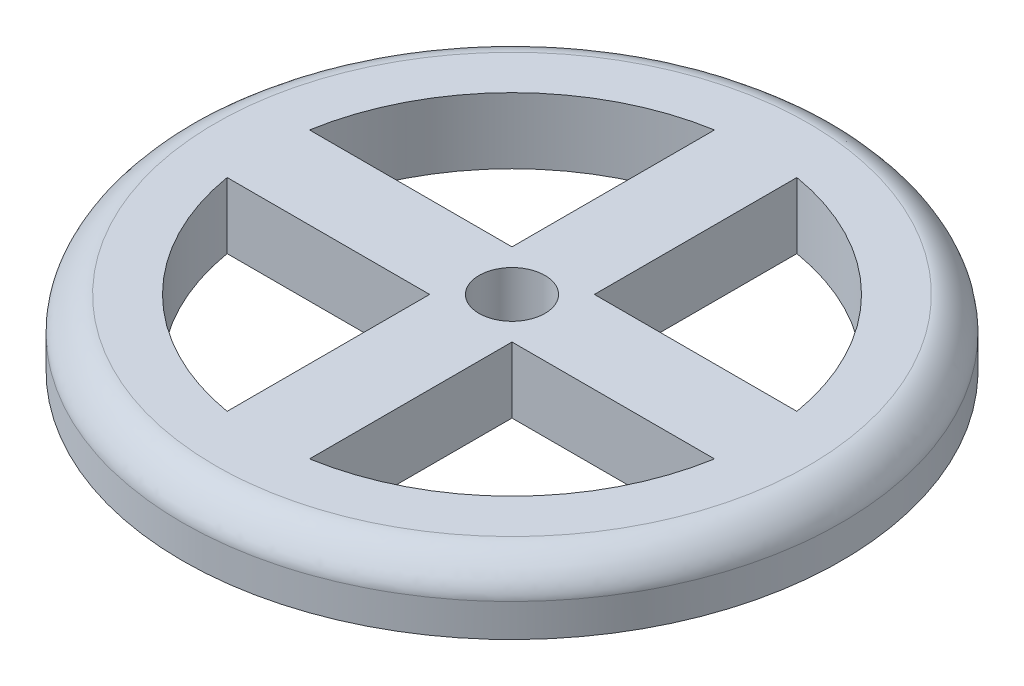
ISO-10303-21;
HEADER;
FILE_DESCRIPTION(('STEP AP214'),'2;1');
FILE_NAME('part.step','',(''),(''),'','','');
FILE_SCHEMA(('AUTOMOTIVE_DESIGN { 1 0 10303 214 1 1 1 1 }'));
ENDSEC;
DATA;
#1=APPLICATION_CONTEXT('core data for automotive mechanical design processes');
#2=APPLICATION_PROTOCOL_DEFINITION('international standard','automotive_design',2000,#1);
#3=PRODUCT_CONTEXT('',#1,'mechanical');
#4=PRODUCT('Part','Part','',(#3));
#5=PRODUCT_RELATED_PRODUCT_CATEGORY('part','',(#4));
#6=PRODUCT_DEFINITION_FORMATION('','',#4);
#7=PRODUCT_DEFINITION_CONTEXT('part definition',#1,'design');
#8=PRODUCT_DEFINITION('design','',#6,#7);
#9=PRODUCT_DEFINITION_SHAPE('','',#8);
#10=(LENGTH_UNIT() NAMED_UNIT(*) SI_UNIT(.MILLI.,.METRE.));
#11=(NAMED_UNIT(*) PLANE_ANGLE_UNIT() SI_UNIT($,.RADIAN.));
#12=(NAMED_UNIT(*) SI_UNIT($,.STERADIAN.) SOLID_ANGLE_UNIT());
#13=UNCERTAINTY_MEASURE_WITH_UNIT(LENGTH_MEASURE(1.E-05),#10,'distance_accuracy_value','');
#14=(GEOMETRIC_REPRESENTATION_CONTEXT(3) GLOBAL_UNCERTAINTY_ASSIGNED_CONTEXT((#13)) GLOBAL_UNIT_ASSIGNED_CONTEXT((#10,
#11,#12)) REPRESENTATION_CONTEXT('',''));
#15=CARTESIAN_POINT('',(0.,0.,0.));
#16=DIRECTION('',(0.,0.,1.));
#17=DIRECTION('',(1.,0.,0.));
#18=AXIS2_PLACEMENT_3D('',#15,#16,#17);
#19=CARTESIAN_POINT('',(-2.5,4.,0.));
#20=DIRECTION('',(1.,0.,0.));
#21=DIRECTION('',(0.,0.,-1.));
#22=AXIS2_PLACEMENT_3D('',#19,#20,#21);
#23=PLANE('',#22);
#24=DIRECTION('',(0.,0.,1.));
#25=VECTOR('',#24,1.);
#26=CARTESIAN_POINT('',(-2.5,0.,0.));
#27=LINE('',#26,#25);
#28=CARTESIAN_POINT('',(-2.5,0.,-14.790199457749));
#29=VERTEX_POINT('',#28);
#30=CARTESIAN_POINT('',(-2.5,0.,-2.5));
#31=VERTEX_POINT('',#30);
#32=EDGE_CURVE('E153',#29,#31,#27,.T.);
#33=ORIENTED_EDGE('',*,*,#32,.T.);
#34=DIRECTION('',(0.,-1.,0.));
#35=VECTOR('',#34,1.);
#36=CARTESIAN_POINT('',(-2.5,4.,-2.5));
#37=LINE('',#36,#35);
#38=CARTESIAN_POINT('',(-2.5,4.,-2.5));
#39=VERTEX_POINT('',#38);
#40=EDGE_CURVE('E152',#39,#31,#37,.T.);
#41=ORIENTED_EDGE('',*,*,#40,.F.);
#42=DIRECTION('',(0.,0.,1.));
#43=VECTOR('',#42,1.);
#44=CARTESIAN_POINT('',(-2.5,4.,0.));
#45=LINE('',#44,#43);
#46=CARTESIAN_POINT('',(-2.5,4.,-14.790199457749));
#47=VERTEX_POINT('',#46);
#48=EDGE_CURVE('E143',#47,#39,#45,.T.);
#49=ORIENTED_EDGE('',*,*,#48,.F.);
#50=DIRECTION('',(0.,-1.,0.));
#51=VECTOR('',#50,1.);
#52=CARTESIAN_POINT('',(-2.5,4.,-14.790199457749));
#53=LINE('',#52,#51);
#54=EDGE_CURVE('E64',#47,#29,#53,.T.);
#55=ORIENTED_EDGE('',*,*,#54,.T.);
#56=EDGE_LOOP('',(#33,#41,#49,#55));
#57=FACE_BOUND('',#56,.T.);
#58=ADVANCED_FACE('F41',(#57),#23,.F.);
#59=CARTESIAN_POINT('',(0.,4.,-2.5));
#60=DIRECTION('',(0.,0.,-1.));
#61=DIRECTION('',(-1.,0.,0.));
#62=AXIS2_PLACEMENT_3D('',#59,#60,#61);
#63=PLANE('',#62);
#64=DIRECTION('',(1.,0.,0.));
#65=VECTOR('',#64,1.);
#66=CARTESIAN_POINT('',(0.,0.,-2.5));
#67=LINE('',#66,#65);
#68=CARTESIAN_POINT('',(-14.790199457749,0.,-2.5));
#69=VERTEX_POINT('',#68);
#70=EDGE_CURVE('E192',#69,#31,#67,.T.);
#71=ORIENTED_EDGE('',*,*,#70,.F.);
#72=DIRECTION('',(0.,-1.,0.));
#73=VECTOR('',#72,1.);
#74=CARTESIAN_POINT('',(-14.790199457749,4.,-2.5));
#75=LINE('',#74,#73);
#76=CARTESIAN_POINT('',(-14.790199457749,4.,-2.5));
#77=VERTEX_POINT('',#76);
#78=EDGE_CURVE('E102',#77,#69,#75,.T.);
#79=ORIENTED_EDGE('',*,*,#78,.F.);
#80=DIRECTION('',(1.,0.,0.));
#81=VECTOR('',#80,1.);
#82=CARTESIAN_POINT('',(0.,4.,-2.5));
#83=LINE('',#82,#81);
#84=EDGE_CURVE('E148',#77,#39,#83,.T.);
#85=ORIENTED_EDGE('',*,*,#84,.T.);
#86=ORIENTED_EDGE('',*,*,#40,.T.);
#87=EDGE_LOOP('',(#71,#79,#85,#86));
#88=FACE_BOUND('',#87,.T.);
#89=ADVANCED_FACE('F157',(#88),#63,.T.);
#90=CARTESIAN_POINT('',(2.5,4.,0.));
#91=DIRECTION('',(1.,0.,0.));
#92=DIRECTION('',(0.,0.,-1.));
#93=AXIS2_PLACEMENT_3D('',#90,#91,#92);
#94=PLANE('',#93);
#95=DIRECTION('',(0.,0.,1.));
#96=VECTOR('',#95,1.);
#97=CARTESIAN_POINT('',(2.5,0.,0.));
#98=LINE('',#97,#96);
#99=CARTESIAN_POINT('',(2.5,0.,2.5));
#100=VERTEX_POINT('',#99);
#101=CARTESIAN_POINT('',(2.5,0.,14.790199457749));
#102=VERTEX_POINT('',#101);
#103=EDGE_CURVE('E184',#100,#102,#98,.T.);
#104=ORIENTED_EDGE('',*,*,#103,.F.);
#105=DIRECTION('',(0.,-1.,0.));
#106=VECTOR('',#105,1.);
#107=CARTESIAN_POINT('',(2.5,4.,2.5));
#108=LINE('',#107,#106);
#109=CARTESIAN_POINT('',(2.5,4.,2.5));
#110=VERTEX_POINT('',#109);
#111=EDGE_CURVE('E202',#110,#100,#108,.T.);
#112=ORIENTED_EDGE('',*,*,#111,.F.);
#113=DIRECTION('',(0.,0.,1.));
#114=VECTOR('',#113,1.);
#115=CARTESIAN_POINT('',(2.5,4.,0.));
#116=LINE('',#115,#114);
#117=CARTESIAN_POINT('',(2.5,4.,14.790199457749));
#118=VERTEX_POINT('',#117);
#119=EDGE_CURVE('E326',#110,#118,#116,.T.);
#120=ORIENTED_EDGE('',*,*,#119,.T.);
#121=DIRECTION('',(0.,-1.,0.));
#122=VECTOR('',#121,1.);
#123=CARTESIAN_POINT('',(2.5,4.,14.790199457749));
#124=LINE('',#123,#122);
#125=EDGE_CURVE('E204',#118,#102,#124,.T.);
#126=ORIENTED_EDGE('',*,*,#125,.T.);
#127=EDGE_LOOP('',(#104,#112,#120,#126));
#128=FACE_BOUND('',#127,.T.);
#129=ADVANCED_FACE('F287',(#128),#94,.T.);
#130=CARTESIAN_POINT('',(0.,4.,2.5));
#131=DIRECTION('',(0.,0.,-1.));
#132=DIRECTION('',(-1.,0.,0.));
#133=AXIS2_PLACEMENT_3D('',#130,#131,#132);
#134=PLANE('',#133);
#135=DIRECTION('',(1.,0.,0.));
#136=VECTOR('',#135,1.);
#137=CARTESIAN_POINT('',(0.,0.,2.5));
#138=LINE('',#137,#136);
#139=CARTESIAN_POINT('',(14.790199457749,0.,2.5));
#140=VERTEX_POINT('',#139);
#141=EDGE_CURVE('E187',#100,#140,#138,.T.);
#142=ORIENTED_EDGE('',*,*,#141,.T.);
#143=DIRECTION('',(0.,-1.,0.));
#144=VECTOR('',#143,1.);
#145=CARTESIAN_POINT('',(14.790199457749,4.,2.5));
#146=LINE('',#145,#144);
#147=CARTESIAN_POINT('',(14.790199457749,4.,2.5));
#148=VERTEX_POINT('',#147);
#149=EDGE_CURVE('E206',#148,#140,#146,.T.);
#150=ORIENTED_EDGE('',*,*,#149,.F.);
#151=DIRECTION('',(1.,0.,0.));
#152=VECTOR('',#151,1.);
#153=CARTESIAN_POINT('',(0.,4.,2.5));
#154=LINE('',#153,#152);
#155=EDGE_CURVE('E330',#110,#148,#154,.T.);
#156=ORIENTED_EDGE('',*,*,#155,.F.);
#157=ORIENTED_EDGE('',*,*,#111,.T.);
#158=EDGE_LOOP('',(#142,#150,#156,#157));
#159=FACE_BOUND('',#158,.T.);
#160=ADVANCED_FACE('F289',(#159),#134,.F.);
#161=CARTESIAN_POINT('',(0.,4.,-2.5));
#162=DIRECTION('',(0.,0.,-1.));
#163=DIRECTION('',(-1.,0.,0.));
#164=AXIS2_PLACEMENT_3D('',#161,#162,#163);
#165=PLANE('',#164);
#166=DIRECTION('',(1.,0.,0.));
#167=VECTOR('',#166,1.);
#168=CARTESIAN_POINT('',(0.,0.,-2.5));
#169=LINE('',#168,#167);
#170=CARTESIAN_POINT('',(2.5,0.,-2.5));
#171=VERTEX_POINT('',#170);
#172=CARTESIAN_POINT('',(14.790199457749,0.,-2.5));
#173=VERTEX_POINT('',#172);
#174=EDGE_CURVE('E176',#171,#173,#169,.T.);
#175=ORIENTED_EDGE('',*,*,#174,.F.);
#176=DIRECTION('',(0.,-1.,0.));
#177=VECTOR('',#176,1.);
#178=CARTESIAN_POINT('',(2.5,4.,-2.5));
#179=LINE('',#178,#177);
#180=CARTESIAN_POINT('',(2.5,4.,-2.5));
#181=VERTEX_POINT('',#180);
#182=EDGE_CURVE('E207',#181,#171,#179,.T.);
#183=ORIENTED_EDGE('',*,*,#182,.F.);
#184=DIRECTION('',(1.,0.,0.));
#185=VECTOR('',#184,1.);
#186=CARTESIAN_POINT('',(0.,4.,-2.5));
#187=LINE('',#186,#185);
#188=CARTESIAN_POINT('',(14.790199457749,4.,-2.5));
#189=VERTEX_POINT('',#188);
#190=EDGE_CURVE('E319',#181,#189,#187,.T.);
#191=ORIENTED_EDGE('',*,*,#190,.T.);
#192=DIRECTION('',(0.,-1.,0.));
#193=VECTOR('',#192,1.);
#194=CARTESIAN_POINT('',(14.790199457749,4.,-2.5));
#195=LINE('',#194,#193);
#196=EDGE_CURVE('E210',#189,#173,#195,.T.);
#197=ORIENTED_EDGE('',*,*,#196,.T.);
#198=EDGE_LOOP('',(#175,#183,#191,#197));
#199=FACE_BOUND('',#198,.T.);
#200=ADVANCED_FACE('F292',(#199),#165,.T.);
#201=CARTESIAN_POINT('',(2.5,4.,0.));
#202=DIRECTION('',(1.,0.,0.));
#203=DIRECTION('',(0.,0.,-1.));
#204=AXIS2_PLACEMENT_3D('',#201,#202,#203);
#205=PLANE('',#204);
#206=DIRECTION('',(0.,0.,1.));
#207=VECTOR('',#206,1.);
#208=CARTESIAN_POINT('',(2.5,0.,0.));
#209=LINE('',#208,#207);
#210=CARTESIAN_POINT('',(2.5,0.,-14.790199457749));
#211=VERTEX_POINT('',#210);
#212=EDGE_CURVE('E181',#211,#171,#209,.T.);
#213=ORIENTED_EDGE('',*,*,#212,.F.);
#214=DIRECTION('',(0.,-1.,0.));
#215=VECTOR('',#214,1.);
#216=CARTESIAN_POINT('',(2.5,4.,-14.790199457749));
#217=LINE('',#216,#215);
#218=CARTESIAN_POINT('',(2.5,4.,-14.790199457749));
#219=VERTEX_POINT('',#218);
#220=EDGE_CURVE('E212',#219,#211,#217,.T.);
#221=ORIENTED_EDGE('',*,*,#220,.F.);
#222=DIRECTION('',(0.,0.,1.));
#223=VECTOR('',#222,1.);
#224=CARTESIAN_POINT('',(2.5,4.,0.));
#225=LINE('',#224,#223);
#226=EDGE_CURVE('E322',#219,#181,#225,.T.);
#227=ORIENTED_EDGE('',*,*,#226,.T.);
#228=ORIENTED_EDGE('',*,*,#182,.T.);
#229=EDGE_LOOP('',(#213,#221,#227,#228));
#230=FACE_BOUND('',#229,.T.);
#231=ADVANCED_FACE('F297',(#230),#205,.T.);
#232=CARTESIAN_POINT('',(0.,4.,2.5));
#233=DIRECTION('',(0.,0.,-1.));
#234=DIRECTION('',(-1.,0.,0.));
#235=AXIS2_PLACEMENT_3D('',#232,#233,#234);
#236=PLANE('',#235);
#237=DIRECTION('',(1.,0.,0.));
#238=VECTOR('',#237,1.);
#239=CARTESIAN_POINT('',(0.,0.,2.5));
#240=LINE('',#239,#238);
#241=CARTESIAN_POINT('',(-14.790199457749,0.,2.5));
#242=VERTEX_POINT('',#241);
#243=CARTESIAN_POINT('',(-2.5,0.,2.5));
#244=VERTEX_POINT('',#243);
#245=EDGE_CURVE('E167',#242,#244,#240,.T.);
#246=ORIENTED_EDGE('',*,*,#245,.T.);
#247=DIRECTION('',(0.,-1.,0.));
#248=VECTOR('',#247,1.);
#249=CARTESIAN_POINT('',(-2.5,4.,2.5));
#250=LINE('',#249,#248);
#251=CARTESIAN_POINT('',(-2.5,4.,2.5));
#252=VERTEX_POINT('',#251);
#253=EDGE_CURVE('E213',#252,#244,#250,.T.);
#254=ORIENTED_EDGE('',*,*,#253,.F.);
#255=DIRECTION('',(1.,0.,0.));
#256=VECTOR('',#255,1.);
#257=CARTESIAN_POINT('',(0.,4.,2.5));
#258=LINE('',#257,#256);
#259=CARTESIAN_POINT('',(-14.790199457749,4.,2.5));
#260=VERTEX_POINT('',#259);
#261=EDGE_CURVE('E200',#260,#252,#258,.T.);
#262=ORIENTED_EDGE('',*,*,#261,.F.);
#263=DIRECTION('',(0.,-1.,0.));
#264=VECTOR('',#263,1.);
#265=CARTESIAN_POINT('',(-14.790199457749,4.,2.5));
#266=LINE('',#265,#264);
#267=EDGE_CURVE('E166',#260,#242,#266,.T.);
#268=ORIENTED_EDGE('',*,*,#267,.T.);
#269=EDGE_LOOP('',(#246,#254,#262,#268));
#270=FACE_BOUND('',#269,.T.);
#271=ADVANCED_FACE('F300',(#270),#236,.F.);
#272=CARTESIAN_POINT('',(-2.5,4.,0.));
#273=DIRECTION('',(1.,0.,0.));
#274=DIRECTION('',(0.,0.,-1.));
#275=AXIS2_PLACEMENT_3D('',#272,#273,#274);
#276=PLANE('',#275);
#277=DIRECTION('',(0.,0.,1.));
#278=VECTOR('',#277,1.);
#279=CARTESIAN_POINT('',(-2.5,0.,0.));
#280=LINE('',#279,#278);
#281=CARTESIAN_POINT('',(-2.5,0.,14.790199457749));
#282=VERTEX_POINT('',#281);
#283=EDGE_CURVE('E170',#244,#282,#280,.T.);
#284=ORIENTED_EDGE('',*,*,#283,.T.);
#285=DIRECTION('',(0.,-1.,0.));
#286=VECTOR('',#285,1.);
#287=CARTESIAN_POINT('',(-2.5,4.,14.790199457749));
#288=LINE('',#287,#286);
#289=CARTESIAN_POINT('',(-2.5,4.,14.790199457749));
#290=VERTEX_POINT('',#289);
#291=EDGE_CURVE('E217',#290,#282,#288,.T.);
#292=ORIENTED_EDGE('',*,*,#291,.F.);
#293=DIRECTION('',(0.,0.,1.));
#294=VECTOR('',#293,1.);
#295=CARTESIAN_POINT('',(-2.5,4.,0.));
#296=LINE('',#295,#294);
#297=EDGE_CURVE('E115',#252,#290,#296,.T.);
#298=ORIENTED_EDGE('',*,*,#297,.F.);
#299=ORIENTED_EDGE('',*,*,#253,.T.);
#300=EDGE_LOOP('',(#284,#292,#298,#299));
#301=FACE_BOUND('',#300,.T.);
#302=ADVANCED_FACE('F251',(#301),#276,.F.);
#303=CARTESIAN_POINT('',(0.,4.,0.));
#304=DIRECTION('',(0.,-1.,0.));
#305=DIRECTION('',(0.,0.,-1.));
#306=AXIS2_PLACEMENT_3D('',#303,#304,#305);
#307=CYLINDRICAL_SURFACE('',#306,20.);
#308=CARTESIAN_POINT('',(0.,2.,20.));
#309=CARTESIAN_POINT('',(1.30899693832957,2.,20.));
#310=CARTESIAN_POINT('',(2.61796151112264,2.,19.8710782422801));
#311=CARTESIAN_POINT('',(5.1856513695225,2.,19.3603329738491));
#312=CARTESIAN_POINT('',(6.44431316786531,2.,18.9785220915386));
#313=CARTESIAN_POINT('',(8.86302412673829,2.,17.9766592089129));
#314=CARTESIAN_POINT('',(10.0230134835804,2.,17.3566319800963));
#315=CARTESIAN_POINT('',(12.1997958372037,2.,15.9021525120055));
#316=CARTESIAN_POINT('',(13.2165350120906,2.,15.0677362353713));
#317=CARTESIAN_POINT('',(15.0677362353713,2.,13.2165350120906));
#318=CARTESIAN_POINT('',(15.9021525120058,2.,12.1997958372032));
#319=CARTESIAN_POINT('',(17.356631980096,2.,10.0230134835808));
#320=CARTESIAN_POINT('',(17.9766592089129,2.,8.86302412673833));
#321=CARTESIAN_POINT('',(18.9785220915386,2.,6.44431316786525));
#322=CARTESIAN_POINT('',(19.3603329738492,2.,5.18565136952208));
#323=CARTESIAN_POINT('',(19.87107824228,2.,2.61796151112308));
#324=CARTESIAN_POINT('',(20.,2.,1.3089969383224));
#325=CARTESIAN_POINT('',(20.,2.,-1.30899693832239));
#326=CARTESIAN_POINT('',(19.87107824228,2.,-2.6179615111233));
#327=CARTESIAN_POINT('',(19.3603329738492,2.,-5.1856513695218));
#328=CARTESIAN_POINT('',(18.9785220915382,2.,-6.44431316786614));
#329=CARTESIAN_POINT('',(17.9766592089133,2.,-8.86302412673747));
#330=CARTESIAN_POINT('',(17.3566319800964,2.,-10.0230134835803));
#331=CARTESIAN_POINT('',(15.9021525120055,2.,-12.1997958372038));
#332=CARTESIAN_POINT('',(15.0677362353716,2.,-13.2165350120903));
#333=CARTESIAN_POINT('',(13.2165350120902,2.,-15.0677362353717));
#334=CARTESIAN_POINT('',(12.1997958372047,2.,-15.9021525120048));
#335=CARTESIAN_POINT('',(10.0230134835794,2.,-17.356631980097));
#336=CARTESIAN_POINT('',(8.86302412673793,2.,-17.9766592089131));
#337=CARTESIAN_POINT('',(6.44431316786572,2.,-18.9785220915384));
#338=CARTESIAN_POINT('',(5.18565136952208,2.,-19.3603329738492));
#339=CARTESIAN_POINT('',(2.61796151112308,2.,-19.87107824228));
#340=CARTESIAN_POINT('',(1.3089969383224,2.,-20.));
#341=CARTESIAN_POINT('',(-1.30899693832239,2.,-20.));
#342=CARTESIAN_POINT('',(-2.61796151112281,2.,-19.8710782422801));
#343=CARTESIAN_POINT('',(-5.18565136952229,2.,-19.3603329738491));
#344=CARTESIAN_POINT('',(-6.44431316786566,2.,-18.9785220915384));
#345=CARTESIAN_POINT('',(-8.86302412673787,2.,-17.9766592089131));
#346=CARTESIAN_POINT('',(-10.0230134835794,2.,-17.356631980097));
#347=CARTESIAN_POINT('',(-12.1997958372047,2.,-15.9021525120048));
#348=CARTESIAN_POINT('',(-13.2165350120908,2.,-15.0677362353711));
#349=CARTESIAN_POINT('',(-15.0677362353711,2.,-13.2165350120908));
#350=CARTESIAN_POINT('',(-15.9021525120056,2.,-12.1997958372036));
#351=CARTESIAN_POINT('',(-17.3566319800962,2.,-10.0230134835806));
#352=CARTESIAN_POINT('',(-17.9766592089133,2.,-8.86302412673727));
#353=CARTESIAN_POINT('',(-18.9785220915381,2.,-6.44431316786638));
#354=CARTESIAN_POINT('',(-19.3603329738492,2.,-5.18565136952166));
#355=CARTESIAN_POINT('',(-19.87107824228,2.,-2.61796151112353));
#356=CARTESIAN_POINT('',(-20.,2.,-1.30899693832236));
#357=CARTESIAN_POINT('',(-20.,2.,1.30899693832243));
#358=CARTESIAN_POINT('',(-19.8710782422801,2.,2.61796151112285));
#359=CARTESIAN_POINT('',(-19.3603329738491,2.,5.18565136952225));
#360=CARTESIAN_POINT('',(-18.9785220915381,2.,6.44431316786632));
#361=CARTESIAN_POINT('',(-17.9766592089134,2.,8.86302412673721));
#362=CARTESIAN_POINT('',(-17.3566319800967,2.,10.0230134835798));
#363=CARTESIAN_POINT('',(-15.9021525120051,2.,12.1997958372042));
#364=CARTESIAN_POINT('',(-15.0677362353709,2.,13.216535012091));
#365=CARTESIAN_POINT('',(-13.2165350120911,2.,15.0677362353708));
#366=CARTESIAN_POINT('',(-12.199795837205,2.,15.9021525120047));
#367=CARTESIAN_POINT('',(-10.0230134835791,2.,17.3566319800971));
#368=CARTESIAN_POINT('',(-8.86302412673799,2.,17.976659208913));
#369=CARTESIAN_POINT('',(-6.44431316786566,2.,18.9785220915384));
#370=CARTESIAN_POINT('',(-5.18565136952176,2.,19.3603329738492));
#371=CARTESIAN_POINT('',(-2.61796151112343,2.,19.87107824228));
#372=CARTESIAN_POINT('',(-1.30899693832957,2.,20.));
#373=CARTESIAN_POINT('',(0.,2.,20.));
#374=(BOUNDED_CURVE() B_SPLINE_CURVE(3,(#308,#309,#310,#311,#312,#313,#314,#315,#316,#317,#318,
#319,#320,#321,#322,#323,#324,#325,#326,#327,#328,#329,#330,#331,#332,#333,#334,#335,#336,#337,
#338,#339,#340,#341,#342,#343,#344,#345,#346,#347,#348,#349,#350,#351,#352,#353,#354,#355,#356,
#357,#358,#359,#360,#361,#362,#363,#364,#365,#366,#367,#368,#369,#370,#371,#372,#373),
.UNSPECIFIED.,.T.,.F.) B_SPLINE_CURVE_WITH_KNOTS((4,2,2,2,2,2,2,2,2,2,2,2,2,2,2,2,2,2,2,2,2,2,2,
2,2,2,2,2,2,2,2,2,4),(0.,0.196349540849362,0.392699081698724,0.589048622548086,
0.785398163397448,0.98174770424681,1.17809724509617,1.37444678594553,1.5707963267949,
1.76714586764426,1.96349540849362,2.15984494934298,2.35619449019234,2.55254403104171,
2.74889357189107,2.94524311274043,3.14159265358979,3.33794219443916,3.53429173528852,
3.73064127613788,3.92699081698724,4.1233403578366,4.31968989868597,4.51603943953533,
4.71238898038469,4.90873852123405,5.10508806208341,5.30143760293278,5.49778714378214,
5.6941366846315,5.89048622548086,6.08683576633022,6.28318530717959),
.UNSPECIFIED.) CURVE() GEOMETRIC_REPRESENTATION_ITEM() RATIONAL_B_SPLINE_CURVE((1.,1.,1.,1.,1.,
1.,1.,1.,1.,1.,1.,1.,1.,1.,1.,1.,1.,1.,1.,1.,1.,1.,1.,1.,1.,1.,1.,1.,1.,1.,1.,1.,1.,1.,1.,1.,1.,
1.,1.,1.,1.,1.,1.,1.,1.,1.,1.,1.,1.,1.,1.,1.,1.,1.,1.,1.,1.,1.,1.,1.,1.,1.,1.,1.,1.,1.)) REPRESENTATION_ITEM(''));
#375=CARTESIAN_POINT('',(0.,2.,20.));
#376=VERTEX_POINT('',#375);
#377=EDGE_CURVE('E12',#376,#376,#374,.F.);
#378=ORIENTED_EDGE('',*,*,#377,.T.);
#379=EDGE_LOOP('',(#378));
#380=FACE_BOUND('',#379,.T.);
#381=CARTESIAN_POINT('',(0.,0.,0.));
#382=DIRECTION('',(0.,1.,0.));
#383=DIRECTION('',(0.,0.,1.));
#384=AXIS2_PLACEMENT_3D('',#381,#382,#383);
#385=CIRCLE('',#384,20.);
#386=CARTESIAN_POINT('',(0.,0.,20.));
#387=VERTEX_POINT('',#386);
#388=EDGE_CURVE('E194',#387,#387,#385,.T.);
#389=ORIENTED_EDGE('',*,*,#388,.T.);
#390=EDGE_LOOP('',(#389));
#391=FACE_BOUND('',#390,.T.);
#392=ADVANCED_FACE('F246',(#380,#391),#307,.T.);
#393=CARTESIAN_POINT('',(0.,4.,0.));
#394=DIRECTION('',(0.,-1.,0.));
#395=DIRECTION('',(0.,0.,-1.));
#396=AXIS2_PLACEMENT_3D('',#393,#394,#395);
#397=CYLINDRICAL_SURFACE('',#396,15.);
#398=CARTESIAN_POINT('',(0.,0.,0.));
#399=DIRECTION('',(0.,1.,0.));
#400=DIRECTION('',(0.,0.,1.));
#401=AXIS2_PLACEMENT_3D('',#398,#399,#400);
#402=CIRCLE('',#401,15.);
#403=EDGE_CURVE('E177',#29,#69,#402,.T.);
#404=ORIENTED_EDGE('',*,*,#403,.F.);
#405=ORIENTED_EDGE('',*,*,#54,.F.);
#406=CARTESIAN_POINT('',(0.,4.,0.));
#407=DIRECTION('',(0.,1.,0.));
#408=DIRECTION('',(0.,0.,1.));
#409=AXIS2_PLACEMENT_3D('',#406,#407,#408);
#410=CIRCLE('',#409,15.);
#411=EDGE_CURVE('E149',#47,#77,#410,.T.);
#412=ORIENTED_EDGE('',*,*,#411,.T.);
#413=ORIENTED_EDGE('',*,*,#78,.T.);
#414=EDGE_LOOP('',(#404,#405,#412,#413));
#415=FACE_BOUND('',#414,.T.);
#416=ADVANCED_FACE('F250',(#415),#397,.F.);
#417=EDGE_CURVE('E190',#102,#140,#402,.T.);
#418=ORIENTED_EDGE('',*,*,#417,.F.);
#419=ORIENTED_EDGE('',*,*,#125,.F.);
#420=EDGE_CURVE('E150',#118,#148,#410,.T.);
#421=ORIENTED_EDGE('',*,*,#420,.T.);
#422=ORIENTED_EDGE('',*,*,#149,.T.);
#423=EDGE_LOOP('',(#418,#419,#421,#422));
#424=FACE_BOUND('',#423,.T.);
#425=ADVANCED_FACE('F344',(#424),#397,.F.);
#426=EDGE_CURVE('E178',#173,#211,#402,.T.);
#427=ORIENTED_EDGE('',*,*,#426,.F.);
#428=ORIENTED_EDGE('',*,*,#196,.F.);
#429=EDGE_CURVE('E320',#189,#219,#410,.T.);
#430=ORIENTED_EDGE('',*,*,#429,.T.);
#431=ORIENTED_EDGE('',*,*,#220,.T.);
#432=EDGE_LOOP('',(#427,#428,#430,#431));
#433=FACE_BOUND('',#432,.T.);
#434=ADVANCED_FACE('F353',(#433),#397,.F.);
#435=EDGE_CURVE('E173',#242,#282,#402,.T.);
#436=ORIENTED_EDGE('',*,*,#435,.F.);
#437=ORIENTED_EDGE('',*,*,#267,.F.);
#438=EDGE_CURVE('E161',#260,#290,#410,.T.);
#439=ORIENTED_EDGE('',*,*,#438,.T.);
#440=ORIENTED_EDGE('',*,*,#291,.T.);
#441=EDGE_LOOP('',(#436,#437,#439,#440));
#442=FACE_BOUND('',#441,.T.);
#443=ADVANCED_FACE('F244',(#442),#397,.F.);
#444=CARTESIAN_POINT('',(0.,4.,0.));
#445=DIRECTION('',(0.,-1.,0.));
#446=DIRECTION('',(0.,0.,-1.));
#447=AXIS2_PLACEMENT_3D('',#444,#445,#446);
#448=CYLINDRICAL_SURFACE('',#447,2.);
#449=CARTESIAN_POINT('',(0.,4.,0.));
#450=DIRECTION('',(0.,1.,0.));
#451=DIRECTION('',(0.,0.,1.));
#452=AXIS2_PLACEMENT_3D('',#449,#450,#451);
#453=CIRCLE('',#452,2.);
#454=CARTESIAN_POINT('',(0.,4.,2.));
#455=VERTEX_POINT('',#454);
#456=EDGE_CURVE('E159',#455,#455,#453,.T.);
#457=ORIENTED_EDGE('',*,*,#456,.T.);
#458=EDGE_LOOP('',(#457));
#459=FACE_BOUND('',#458,.T.);
#460=CARTESIAN_POINT('',(0.,0.,0.));
#461=DIRECTION('',(0.,1.,0.));
#462=DIRECTION('',(0.,0.,1.));
#463=AXIS2_PLACEMENT_3D('',#460,#461,#462);
#464=CIRCLE('',#463,2.);
#465=CARTESIAN_POINT('',(0.,0.,2.));
#466=VERTEX_POINT('',#465);
#467=EDGE_CURVE('E197',#466,#466,#464,.T.);
#468=ORIENTED_EDGE('',*,*,#467,.F.);
#469=EDGE_LOOP('',(#468));
#470=FACE_BOUND('',#469,.T.);
#471=ADVANCED_FACE('F238',(#459,#470),#448,.F.);
#472=CARTESIAN_POINT('',(0.,4.,0.));
#473=DIRECTION('',(0.,1.,0.));
#474=DIRECTION('',(0.,0.,1.));
#475=AXIS2_PLACEMENT_3D('',#472,#473,#474);
#476=PLANE('',#475);
#477=CARTESIAN_POINT('',(0.,4.,18.));
#478=CARTESIAN_POINT('',(-1.17809724449661,4.,18.));
#479=CARTESIAN_POINT('',(-2.3561653600105,4.,17.8839704180491));
#480=CARTESIAN_POINT('',(-4.66708623257016,4.,17.4242996764672));
#481=CARTESIAN_POINT('',(-5.79988185107918,4.,17.0806698823861));
#482=CARTESIAN_POINT('',(-7.9767217140641,4.,16.1789932880202));
#483=CARTESIAN_POINT('',(-9.02071213522079,4.,15.6209687820875));
#484=CARTESIAN_POINT('',(-10.9798162534849,4.,14.3119372608041));
#485=CARTESIAN_POINT('',(-11.894881510882,4.,13.5609626118337));
#486=CARTESIAN_POINT('',(-13.5609626118338,4.,11.8948815108819));
#487=CARTESIAN_POINT('',(-14.3119372608041,4.,10.9798162534839));
#488=CARTESIAN_POINT('',(-15.6209687820875,4.,9.02071213522179));
#489=CARTESIAN_POINT('',(-16.1789932880222,4.,7.97672171406405));
#490=CARTESIAN_POINT('',(-17.0806698823841,4.,5.79988185107913));
#491=CARTESIAN_POINT('',(-17.4242996764651,4.,4.66708623256987));
#492=CARTESIAN_POINT('',(-17.8839704180512,4.,2.35616536001072));
#493=CARTESIAN_POINT('',(-18.,4.,1.17809724449019));
#494=CARTESIAN_POINT('',(-18.,4.,-1.17809724449013));
#495=CARTESIAN_POINT('',(-17.8839704180512,4.,-2.35616536001076));
#496=CARTESIAN_POINT('',(-17.4242996764651,4.,-4.66708623256991));
#497=CARTESIAN_POINT('',(-17.0806698823841,4.,-5.79988185107918));
#498=CARTESIAN_POINT('',(-16.1789932880222,4.,-7.9767217140641));
#499=CARTESIAN_POINT('',(-15.6209687820875,4.,-9.02071213522284));
#500=CARTESIAN_POINT('',(-14.3119372608041,4.,-10.9798162534829));
#501=CARTESIAN_POINT('',(-13.5609626118353,4.,-11.8948815108825));
#502=CARTESIAN_POINT('',(-11.8948815108804,4.,-13.5609626118332));
#503=CARTESIAN_POINT('',(-10.9798162534835,4.,-14.311937260804));
#504=CARTESIAN_POINT('',(-9.02071213522213,4.,-15.6209687820877));
#505=CARTESIAN_POINT('',(-7.97672171406407,4.,-16.1789932880207));
#506=CARTESIAN_POINT('',(-5.79988185107912,4.,-17.0806698823857));
#507=CARTESIAN_POINT('',(-4.66708623256991,4.,-17.4242996764653));
#508=CARTESIAN_POINT('',(-2.35616536001068,4.,-17.883970418051));
#509=CARTESIAN_POINT('',(-1.17809724449015,4.,-18.));
#510=CARTESIAN_POINT('',(1.17809724449016,4.,-18.));
#511=CARTESIAN_POINT('',(2.35616536001071,4.,-17.883970418053));
#512=CARTESIAN_POINT('',(4.66708623256993,4.,-17.4242996764633));
#513=CARTESIAN_POINT('',(5.79988185107917,4.,-17.0806698823856));
#514=CARTESIAN_POINT('',(7.97672171406412,4.,-16.1789932880207));
#515=CARTESIAN_POINT('',(9.02071213522215,4.,-15.6209687820876));
#516=CARTESIAN_POINT('',(10.9798162534836,4.,-14.311937260804));
#517=CARTESIAN_POINT('',(11.8948815108814,4.,-13.5609626118343));
#518=CARTESIAN_POINT('',(13.5609626118343,4.,-11.8948815108814));
#519=CARTESIAN_POINT('',(14.311937260805,4.,-10.9798162534835));
#520=CARTESIAN_POINT('',(15.6209687820866,4.,-9.02071213522213));
#521=CARTESIAN_POINT('',(16.1789932880227,4.,-7.97672171406359));
#522=CARTESIAN_POINT('',(17.0806698823836,4.,-5.79988185107966));
#523=CARTESIAN_POINT('',(17.4242996764653,4.,-4.66708623256965));
#524=CARTESIAN_POINT('',(17.883970418051,4.,-2.35616536001094));
#525=CARTESIAN_POINT('',(18.,4.,-1.17809724449015));
#526=CARTESIAN_POINT('',(18.,4.,1.17809724449016));
#527=CARTESIAN_POINT('',(17.883970418053,4.,2.35616536001096));
#528=CARTESIAN_POINT('',(17.4242996764633,4.,4.66708623256968));
#529=CARTESIAN_POINT('',(17.0806698823836,4.,5.79988185107913));
#530=CARTESIAN_POINT('',(16.1789932880227,4.,7.97672171406409));
#531=CARTESIAN_POINT('',(15.6209687820863,4.,9.02071213522308));
#532=CARTESIAN_POINT('',(14.3119372608053,4.,10.9798162534826));
#533=CARTESIAN_POINT('',(13.5609626118336,4.,11.8948815108811));
#534=CARTESIAN_POINT('',(11.8948815108821,4.,13.5609626118347));
#535=CARTESIAN_POINT('',(10.9798162534836,4.,14.3119372608053));
#536=CARTESIAN_POINT('',(9.02071213522206,4.,15.6209687820863));
#537=CARTESIAN_POINT('',(7.97672171406403,4.,16.1789932880211));
#538=CARTESIAN_POINT('',(5.79988185107921,4.,17.0806698823852));
#539=CARTESIAN_POINT('',(4.66708623256998,4.,17.4242996764636));
#540=CARTESIAN_POINT('',(2.35616536001064,4.,17.8839704180527));
#541=CARTESIAN_POINT('',(1.17809724449661,4.,18.));
#542=CARTESIAN_POINT('',(0.,4.,18.));
#543=(BOUNDED_CURVE() B_SPLINE_CURVE(3,(#477,#478,#479,#480,#481,#482,#483,#484,#485,#486,#487,
#488,#489,#490,#491,#492,#493,#494,#495,#496,#497,#498,#499,#500,#501,#502,#503,#504,#505,#506,
#507,#508,#509,#510,#511,#512,#513,#514,#515,#516,#517,#518,#519,#520,#521,#522,#523,#524,#525,
#526,#527,#528,#529,#530,#531,#532,#533,#534,#535,#536,#537,#538,#539,#540,#541,#542),
.UNSPECIFIED.,.T.,.F.) B_SPLINE_CURVE_WITH_KNOTS((4,2,2,2,2,2,2,2,2,2,2,2,2,2,2,2,2,2,2,2,2,2,2,
2,2,2,2,2,2,2,2,2,4),(0.,0.196349540849362,0.392699081698725,0.589048622548086,
0.785398163397448,0.981747704246811,1.17809724509617,1.37444678594553,1.5707963267949,
1.76714586764426,1.96349540849362,2.15984494934298,2.35619449019234,2.55254403104171,
2.74889357189107,2.94524311274043,3.14159265358979,3.33794219443916,3.53429173528852,
3.73064127613788,3.92699081698724,4.1233403578366,4.31968989868597,4.51603943953533,
4.71238898038469,4.90873852123405,5.10508806208341,5.30143760293278,5.49778714378214,
5.6941366846315,5.89048622548086,6.08683576633022,6.28318530717959),
.UNSPECIFIED.) CURVE() GEOMETRIC_REPRESENTATION_ITEM() RATIONAL_B_SPLINE_CURVE((1.,1.,1.,1.,1.,
1.,1.,1.,1.,1.,1.,1.,1.,1.,1.,1.,1.,1.,1.,1.,1.,1.,1.,1.,1.,1.,1.,1.,1.,1.,1.,1.,1.,1.,1.,1.,1.,
1.,1.,1.,1.,1.,1.,1.,1.,1.,1.,1.,1.,1.,1.,1.,1.,1.,1.,1.,1.,1.,1.,1.,1.,1.,1.,1.,1.,1.)) REPRESENTATION_ITEM(''));
#544=CARTESIAN_POINT('',(0.,4.,18.));
#545=VERTEX_POINT('',#544);
#546=EDGE_CURVE('E56',#545,#545,#543,.F.);
#547=ORIENTED_EDGE('',*,*,#546,.T.);
#548=EDGE_LOOP('',(#547));
#549=FACE_BOUND('',#548,.T.);
#550=ORIENTED_EDGE('',*,*,#261,.T.);
#551=ORIENTED_EDGE('',*,*,#297,.T.);
#552=ORIENTED_EDGE('',*,*,#438,.F.);
#553=EDGE_LOOP('',(#550,#551,#552));
#554=FACE_BOUND('',#553,.T.);
#555=ORIENTED_EDGE('',*,*,#190,.F.);
#556=ORIENTED_EDGE('',*,*,#226,.F.);
#557=ORIENTED_EDGE('',*,*,#429,.F.);
#558=EDGE_LOOP('',(#555,#556,#557));
#559=FACE_BOUND('',#558,.T.);
#560=ORIENTED_EDGE('',*,*,#119,.F.);
#561=ORIENTED_EDGE('',*,*,#155,.T.);
#562=ORIENTED_EDGE('',*,*,#420,.F.);
#563=EDGE_LOOP('',(#560,#561,#562));
#564=FACE_BOUND('',#563,.T.);
#565=ORIENTED_EDGE('',*,*,#48,.T.);
#566=ORIENTED_EDGE('',*,*,#84,.F.);
#567=ORIENTED_EDGE('',*,*,#411,.F.);
#568=EDGE_LOOP('',(#565,#566,#567));
#569=FACE_BOUND('',#568,.T.);
#570=ORIENTED_EDGE('',*,*,#456,.F.);
#571=EDGE_LOOP('',(#570));
#572=FACE_BOUND('',#571,.T.);
#573=ADVANCED_FACE('F145',(#549,#554,#559,#564,#569,#572),#476,.T.);
#574=CARTESIAN_POINT('',(0.,0.,0.));
#575=DIRECTION('',(0.,1.,0.));
#576=DIRECTION('',(0.,0.,1.));
#577=AXIS2_PLACEMENT_3D('',#574,#575,#576);
#578=PLANE('',#577);
#579=ORIENTED_EDGE('',*,*,#245,.F.);
#580=ORIENTED_EDGE('',*,*,#435,.T.);
#581=ORIENTED_EDGE('',*,*,#283,.F.);
#582=EDGE_LOOP('',(#579,#580,#581));
#583=FACE_BOUND('',#582,.T.);
#584=ORIENTED_EDGE('',*,*,#174,.T.);
#585=ORIENTED_EDGE('',*,*,#426,.T.);
#586=ORIENTED_EDGE('',*,*,#212,.T.);
#587=EDGE_LOOP('',(#584,#585,#586));
#588=FACE_BOUND('',#587,.T.);
#589=ORIENTED_EDGE('',*,*,#103,.T.);
#590=ORIENTED_EDGE('',*,*,#417,.T.);
#591=ORIENTED_EDGE('',*,*,#141,.F.);
#592=EDGE_LOOP('',(#589,#590,#591));
#593=FACE_BOUND('',#592,.T.);
#594=ORIENTED_EDGE('',*,*,#32,.F.);
#595=ORIENTED_EDGE('',*,*,#403,.T.);
#596=ORIENTED_EDGE('',*,*,#70,.T.);
#597=EDGE_LOOP('',(#594,#595,#596));
#598=FACE_BOUND('',#597,.T.);
#599=ORIENTED_EDGE('',*,*,#388,.F.);
#600=EDGE_LOOP('',(#599));
#601=FACE_BOUND('',#600,.T.);
#602=ORIENTED_EDGE('',*,*,#467,.T.);
#603=EDGE_LOOP('',(#602));
#604=FACE_BOUND('',#603,.T.);
#605=ADVANCED_FACE('F237',(#583,#588,#593,#598,#601,#604),#578,.F.);
#606=CARTESIAN_POINT('',(0.,4.,18.));
#607=CARTESIAN_POINT('',(1.17809724449661,4.,18.));
#608=CARTESIAN_POINT('',(2.35616536001064,4.,17.8839704180527));
#609=CARTESIAN_POINT('',(4.66708623256998,4.,17.4242996764636));
#610=CARTESIAN_POINT('',(5.79988185107921,4.,17.0806698823852));
#611=CARTESIAN_POINT('',(7.97672171406403,4.,16.1789932880211));
#612=CARTESIAN_POINT('',(9.02071213522206,4.,15.6209687820863));
#613=CARTESIAN_POINT('',(10.9798162534836,4.,14.3119372608053));
#614=CARTESIAN_POINT('',(11.8948815108821,4.,13.5609626118347));
#615=CARTESIAN_POINT('',(13.5609626118336,4.,11.8948815108811));
#616=CARTESIAN_POINT('',(14.3119372608053,4.,10.9798162534826));
#617=CARTESIAN_POINT('',(15.6209687820863,4.,9.02071213522308));
#618=CARTESIAN_POINT('',(16.1789932880227,4.,7.97672171406409));
#619=CARTESIAN_POINT('',(17.0806698823836,4.,5.79988185107913));
#620=CARTESIAN_POINT('',(17.4242996764633,4.,4.66708623256968));
#621=CARTESIAN_POINT('',(17.883970418053,4.,2.35616536001096));
#622=CARTESIAN_POINT('',(18.,4.,1.17809724449016));
#623=CARTESIAN_POINT('',(18.,4.,-1.17809724449015));
#624=CARTESIAN_POINT('',(17.883970418051,4.,-2.35616536001094));
#625=CARTESIAN_POINT('',(17.4242996764653,4.,-4.66708623256965));
#626=CARTESIAN_POINT('',(17.0806698823836,4.,-5.79988185107966));
#627=CARTESIAN_POINT('',(16.1789932880227,4.,-7.97672171406359));
#628=CARTESIAN_POINT('',(15.6209687820866,4.,-9.02071213522213));
#629=CARTESIAN_POINT('',(14.311937260805,4.,-10.9798162534835));
#630=CARTESIAN_POINT('',(13.5609626118343,4.,-11.8948815108814));
#631=CARTESIAN_POINT('',(11.8948815108814,4.,-13.5609626118343));
#632=CARTESIAN_POINT('',(10.9798162534836,4.,-14.311937260804));
#633=CARTESIAN_POINT('',(9.02071213522215,4.,-15.6209687820876));
#634=CARTESIAN_POINT('',(7.97672171406412,4.,-16.1789932880207));
#635=CARTESIAN_POINT('',(5.79988185107917,4.,-17.0806698823856));
#636=CARTESIAN_POINT('',(4.66708623256993,4.,-17.4242996764633));
#637=CARTESIAN_POINT('',(2.35616536001071,4.,-17.883970418053));
#638=CARTESIAN_POINT('',(1.17809724449016,4.,-18.));
#639=CARTESIAN_POINT('',(-1.17809724449015,4.,-18.));
#640=CARTESIAN_POINT('',(-2.35616536001068,4.,-17.883970418051));
#641=CARTESIAN_POINT('',(-4.66708623256991,4.,-17.4242996764653));
#642=CARTESIAN_POINT('',(-5.79988185107912,4.,-17.0806698823857));
#643=CARTESIAN_POINT('',(-7.97672171406407,4.,-16.1789932880207));
#644=CARTESIAN_POINT('',(-9.02071213522213,4.,-15.6209687820877));
#645=CARTESIAN_POINT('',(-10.9798162534835,4.,-14.311937260804));
#646=CARTESIAN_POINT('',(-11.8948815108804,4.,-13.5609626118332));
#647=CARTESIAN_POINT('',(-13.5609626118353,4.,-11.8948815108825));
#648=CARTESIAN_POINT('',(-14.3119372608041,4.,-10.9798162534829));
#649=CARTESIAN_POINT('',(-15.6209687820875,4.,-9.02071213522284));
#650=CARTESIAN_POINT('',(-16.1789932880222,4.,-7.9767217140641));
#651=CARTESIAN_POINT('',(-17.0806698823841,4.,-5.79988185107918));
#652=CARTESIAN_POINT('',(-17.4242996764651,4.,-4.66708623256991));
#653=CARTESIAN_POINT('',(-17.8839704180512,4.,-2.35616536001076));
#654=CARTESIAN_POINT('',(-18.,4.,-1.17809724449013));
#655=CARTESIAN_POINT('',(-18.,4.,1.17809724449019));
#656=CARTESIAN_POINT('',(-17.8839704180512,4.,2.35616536001072));
#657=CARTESIAN_POINT('',(-17.4242996764651,4.,4.66708623256987));
#658=CARTESIAN_POINT('',(-17.0806698823841,4.,5.79988185107913));
#659=CARTESIAN_POINT('',(-16.1789932880222,4.,7.97672171406405));
#660=CARTESIAN_POINT('',(-15.6209687820875,4.,9.02071213522179));
#661=CARTESIAN_POINT('',(-14.3119372608041,4.,10.9798162534839));
#662=CARTESIAN_POINT('',(-13.5609626118338,4.,11.8948815108819));
#663=CARTESIAN_POINT('',(-11.894881510882,4.,13.5609626118337));
#664=CARTESIAN_POINT('',(-10.9798162534849,4.,14.3119372608041));
#665=CARTESIAN_POINT('',(-9.02071213522079,4.,15.6209687820875));
#666=CARTESIAN_POINT('',(-7.9767217140641,4.,16.1789932880202));
#667=CARTESIAN_POINT('',(-5.79988185107918,4.,17.0806698823861));
#668=CARTESIAN_POINT('',(-4.66708623257016,4.,17.4242996764672));
#669=CARTESIAN_POINT('',(-2.3561653600105,4.,17.8839704180491));
#670=CARTESIAN_POINT('',(-1.17809724449661,4.,18.));
#671=CARTESIAN_POINT('',(0.,4.,18.));
#672=CARTESIAN_POINT('',(0.,4.,20.));
#673=CARTESIAN_POINT('',(1.30899693832957,3.99999999999898,20.));
#674=CARTESIAN_POINT('',(2.61796151112333,4.,19.8710782422823));
#675=CARTESIAN_POINT('',(5.1856513695218,4.,19.3603329738469));
#676=CARTESIAN_POINT('',(6.44431316786601,4.,18.9785220915403));
#677=CARTESIAN_POINT('',(8.86302412673759,4.,17.9766592089112));
#678=CARTESIAN_POINT('',(10.0230134835794,4.,17.3566319800948));
#679=CARTESIAN_POINT('',(12.1997958372047,4.,15.902152512007));
#680=CARTESIAN_POINT('',(13.2165350120911,4.,15.0677362353718));
#681=CARTESIAN_POINT('',(15.0677362353708,4.,13.2165350120901));
#682=CARTESIAN_POINT('',(15.902152512005,3.99999999999999,12.1997958372027));
#683=CARTESIAN_POINT('',(17.3566319800969,3.99999999999999,10.0230134835814));
#684=CARTESIAN_POINT('',(17.9766592089128,4.,8.86302412673827));
#685=CARTESIAN_POINT('',(18.9785220915387,4.,6.44431316786531));
#686=CARTESIAN_POINT('',(19.3603329738485,4.,5.18565136952195));
#687=CARTESIAN_POINT('',(19.8710782422807,4.,2.61796151112321));
#688=CARTESIAN_POINT('',(20.,4.,1.3089969383224));
#689=CARTESIAN_POINT('',(20.,4.,-1.30899693832239));
#690=CARTESIAN_POINT('',(19.8710782422807,4.,-2.61796151112344));
#691=CARTESIAN_POINT('',(19.3603329738485,4.,-5.18565136952167));
#692=CARTESIAN_POINT('',(18.9785220915387,4.,-6.44431316786634));
#693=CARTESIAN_POINT('',(17.9766592089128,4.,-8.86302412673726));
#694=CARTESIAN_POINT('',(17.3566319800963,4.,-10.0230134835803));
#695=CARTESIAN_POINT('',(15.9021525120056,4.,-12.1997958372038));
#696=CARTESIAN_POINT('',(15.0677362353716,3.99999999999795,-13.2165350120903));
#697=CARTESIAN_POINT('',(13.2165350120903,4.00000000000204,-15.0677362353717));
#698=CARTESIAN_POINT('',(12.1997958372038,3.99999999999898,-15.9021525120035));
#699=CARTESIAN_POINT('',(10.0230134835803,4.00000000000102,-17.3566319800983));
#700=CARTESIAN_POINT('',(8.86302412673779,4.,-17.9766592089128));
#701=CARTESIAN_POINT('',(6.44431316786585,4.,-18.9785220915387));
#702=CARTESIAN_POINT('',(5.18565136952221,4.,-19.3603329738485));
#703=CARTESIAN_POINT('',(2.61796151112295,4.,-19.8710782422807));
#704=CARTESIAN_POINT('',(1.3089969383224,4.,-20.));
#705=CARTESIAN_POINT('',(-1.30899693832239,4.,-20.));
#706=CARTESIAN_POINT('',(-2.61796151112292,4.,-19.8710782422807));
#707=CARTESIAN_POINT('',(-5.18565136952218,4.,-19.3603329738485));
#708=CARTESIAN_POINT('',(-6.44431316786529,4.,-18.9785220915387));
#709=CARTESIAN_POINT('',(-8.86302412673825,4.,-17.9766592089128));
#710=CARTESIAN_POINT('',(-10.0230134835803,4.,-17.3566319800983));
#711=CARTESIAN_POINT('',(-12.1997958372038,4.,-15.9021525120035));
#712=CARTESIAN_POINT('',(-13.2165350120892,3.99999999999897,-15.0677362353706));
#713=CARTESIAN_POINT('',(-15.0677362353727,4.00000000000102,-13.2165350120913));
#714=CARTESIAN_POINT('',(-15.9021525120052,4.00000000000102,-12.1997958372033));
#715=CARTESIAN_POINT('',(-17.3566319800966,3.99999999999898,-10.0230134835808));
#716=CARTESIAN_POINT('',(-17.9766592089147,4.,-8.86302412673783));
#717=CARTESIAN_POINT('',(-18.9785220915367,4.,-6.44431316786581));
#718=CARTESIAN_POINT('',(-19.3603329738506,4.,-5.18565136952217));
#719=CARTESIAN_POINT('',(-19.8710782422786,4.,-2.61796151112301));
#720=CARTESIAN_POINT('',(-20.,4.,-1.30899693832236));
#721=CARTESIAN_POINT('',(-20.,4.,1.30899693832243));
#722=CARTESIAN_POINT('',(-19.8710782422807,4.,2.61796151112297));
#723=CARTESIAN_POINT('',(-19.3603329738485,4.,5.18565136952213));
#724=CARTESIAN_POINT('',(-18.9785220915368,4.,6.44431316786524));
#725=CARTESIAN_POINT('',(-17.9766592089147,4.,8.86302412673829));
#726=CARTESIAN_POINT('',(-17.3566319800966,3.99999999999898,10.0230134835798));
#727=CARTESIAN_POINT('',(-15.9021525120052,4.00000000000102,12.1997958372043));
#728=CARTESIAN_POINT('',(-15.0677362353714,4.,13.2165350120915));
#729=CARTESIAN_POINT('',(-13.2165350120905,4.,15.0677362353703));
#730=CARTESIAN_POINT('',(-12.1997958372054,4.00000000000102,15.9021525120052));
#731=CARTESIAN_POINT('',(-10.0230134835788,3.99999999999898,17.3566319800966));
#732=CARTESIAN_POINT('',(-8.86302412673732,4.,17.9766592089127));
#733=CARTESIAN_POINT('',(-6.44431316786632,4.,18.9785220915388));
#734=CARTESIAN_POINT('',(-5.18565136952218,4.,19.3603329738526));
#735=CARTESIAN_POINT('',(-2.61796151112301,4.,19.8710782422766));
#736=CARTESIAN_POINT('',(-1.30899693832957,4.00000000000102,20.));
#737=CARTESIAN_POINT('',(0.,4.,20.));
#738=CARTESIAN_POINT('',(0.,2.,20.));
#739=CARTESIAN_POINT('',(1.30899693832957,2.,20.));
#740=CARTESIAN_POINT('',(2.61796151112264,2.,19.8710782422801));
#741=CARTESIAN_POINT('',(5.1856513695225,2.,19.3603329738491));
#742=CARTESIAN_POINT('',(6.44431316786531,2.,18.9785220915386));
#743=CARTESIAN_POINT('',(8.86302412673829,2.,17.9766592089129));
#744=CARTESIAN_POINT('',(10.0230134835804,2.,17.3566319800963));
#745=CARTESIAN_POINT('',(12.1997958372037,2.,15.9021525120055));
#746=CARTESIAN_POINT('',(13.2165350120906,2.,15.0677362353713));
#747=CARTESIAN_POINT('',(15.0677362353713,2.,13.2165350120906));
#748=CARTESIAN_POINT('',(15.9021525120058,2.,12.1997958372032));
#749=CARTESIAN_POINT('',(17.356631980096,2.,10.0230134835808));
#750=CARTESIAN_POINT('',(17.9766592089129,2.,8.86302412673833));
#751=CARTESIAN_POINT('',(18.9785220915386,2.,6.44431316786525));
#752=CARTESIAN_POINT('',(19.3603329738492,2.,5.18565136952208));
#753=CARTESIAN_POINT('',(19.87107824228,2.,2.61796151112308));
#754=CARTESIAN_POINT('',(20.,2.,1.3089969383224));
#755=CARTESIAN_POINT('',(20.,2.,-1.30899693832239));
#756=CARTESIAN_POINT('',(19.87107824228,2.,-2.6179615111233));
#757=CARTESIAN_POINT('',(19.3603329738492,2.,-5.1856513695218));
#758=CARTESIAN_POINT('',(18.9785220915382,2.,-6.44431316786614));
#759=CARTESIAN_POINT('',(17.9766592089133,2.,-8.86302412673747));
#760=CARTESIAN_POINT('',(17.3566319800964,2.,-10.0230134835803));
#761=CARTESIAN_POINT('',(15.9021525120055,2.,-12.1997958372038));
#762=CARTESIAN_POINT('',(15.0677362353716,2.,-13.2165350120903));
#763=CARTESIAN_POINT('',(13.2165350120902,2.,-15.0677362353717));
#764=CARTESIAN_POINT('',(12.1997958372047,2.,-15.9021525120048));
#765=CARTESIAN_POINT('',(10.0230134835794,2.,-17.356631980097));
#766=CARTESIAN_POINT('',(8.86302412673793,2.,-17.9766592089131));
#767=CARTESIAN_POINT('',(6.44431316786572,2.,-18.9785220915384));
#768=CARTESIAN_POINT('',(5.18565136952208,2.,-19.3603329738492));
#769=CARTESIAN_POINT('',(2.61796151112308,2.,-19.87107824228));
#770=CARTESIAN_POINT('',(1.3089969383224,2.,-20.));
#771=CARTESIAN_POINT('',(-1.30899693832239,2.,-20.));
#772=CARTESIAN_POINT('',(-2.61796151112281,2.,-19.8710782422801));
#773=CARTESIAN_POINT('',(-5.18565136952229,2.,-19.3603329738491));
#774=CARTESIAN_POINT('',(-6.44431316786566,2.,-18.9785220915384));
#775=CARTESIAN_POINT('',(-8.86302412673787,2.,-17.9766592089131));
#776=CARTESIAN_POINT('',(-10.0230134835794,2.,-17.356631980097));
#777=CARTESIAN_POINT('',(-12.1997958372047,2.,-15.9021525120048));
#778=CARTESIAN_POINT('',(-13.2165350120908,2.,-15.0677362353711));
#779=CARTESIAN_POINT('',(-15.0677362353711,2.,-13.2165350120908));
#780=CARTESIAN_POINT('',(-15.9021525120056,2.,-12.1997958372036));
#781=CARTESIAN_POINT('',(-17.3566319800962,2.,-10.0230134835806));
#782=CARTESIAN_POINT('',(-17.9766592089133,2.,-8.86302412673727));
#783=CARTESIAN_POINT('',(-18.9785220915381,2.,-6.44431316786638));
#784=CARTESIAN_POINT('',(-19.3603329738492,2.,-5.18565136952166));
#785=CARTESIAN_POINT('',(-19.87107824228,2.,-2.61796151112353));
#786=CARTESIAN_POINT('',(-20.,2.,-1.30899693832236));
#787=CARTESIAN_POINT('',(-20.,2.,1.30899693832243));
#788=CARTESIAN_POINT('',(-19.8710782422801,2.,2.61796151112285));
#789=CARTESIAN_POINT('',(-19.3603329738491,2.,5.18565136952225));
#790=CARTESIAN_POINT('',(-18.9785220915381,2.,6.44431316786632));
#791=CARTESIAN_POINT('',(-17.9766592089134,2.,8.86302412673721));
#792=CARTESIAN_POINT('',(-17.3566319800967,2.,10.0230134835798));
#793=CARTESIAN_POINT('',(-15.9021525120051,2.,12.1997958372042));
#794=CARTESIAN_POINT('',(-15.0677362353709,2.,13.216535012091));
#795=CARTESIAN_POINT('',(-13.2165350120911,2.,15.0677362353708));
#796=CARTESIAN_POINT('',(-12.199795837205,2.,15.9021525120047));
#797=CARTESIAN_POINT('',(-10.0230134835791,2.,17.3566319800971));
#798=CARTESIAN_POINT('',(-8.86302412673799,2.,17.976659208913));
#799=CARTESIAN_POINT('',(-6.44431316786566,2.,18.9785220915384));
#800=CARTESIAN_POINT('',(-5.18565136952176,2.,19.3603329738492));
#801=CARTESIAN_POINT('',(-2.61796151112343,2.,19.87107824228));
#802=CARTESIAN_POINT('',(-1.30899693832957,2.,20.));
#803=CARTESIAN_POINT('',(0.,2.,20.));
#804=(BOUNDED_SURFACE() B_SPLINE_SURFACE(2,3,((#606,#607,#608,#609,#610,#611,#612,#613,#614,
#615,#616,#617,#618,#619,#620,#621,#622,#623,#624,#625,#626,#627,#628,#629,#630,#631,#632,#633,
#634,#635,#636,#637,#638,#639,#640,#641,#642,#643,#644,#645,#646,#647,#648,#649,#650,#651,#652,
#653,#654,#655,#656,#657,#658,#659,#660,#661,#662,#663,#664,#665,#666,#667,#668,#669,#670,#671),
(#672,#673,#674,#675,#676,#677,#678,#679,#680,#681,#682,#683,#684,#685,#686,#687,#688,#689,#690,
#691,#692,#693,#694,#695,#696,#697,#698,#699,#700,#701,#702,#703,#704,#705,#706,#707,#708,#709,
#710,#711,#712,#713,#714,#715,#716,#717,#718,#719,#720,#721,#722,#723,#724,#725,#726,#727,#728,
#729,#730,#731,#732,#733,#734,#735,#736,#737),(#738,#739,#740,#741,#742,#743,#744,#745,#746,
#747,#748,#749,#750,#751,#752,#753,#754,#755,#756,#757,#758,#759,#760,#761,#762,#763,#764,#765,
#766,#767,#768,#769,#770,#771,#772,#773,#774,#775,#776,#777,#778,#779,#780,#781,#782,#783,#784,
#785,#786,#787,#788,#789,#790,#791,#792,#793,#794,#795,#796,#797,#798,#799,#800,#801,#802,
#803)),.UNSPECIFIED.,.F.,.T.,.F.) B_SPLINE_SURFACE_WITH_KNOTS((3,3),(4,2,2,2,2,2,2,2,2,2,2,2,2,
2,2,2,2,2,2,2,2,2,2,2,2,2,2,2,2,2,2,2,4),(0.,1.),(0.,0.196349540849362,0.392699081698724,
0.589048622548086,0.785398163397448,0.98174770424681,1.17809724509617,1.37444678594553,
1.5707963267949,1.76714586764426,1.96349540849362,2.15984494934298,2.35619449019234,
2.55254403104171,2.74889357189107,2.94524311274043,3.14159265358979,3.33794219443916,
3.53429173528852,3.73064127613788,3.92699081698724,4.1233403578366,4.31968989868597,
4.51603943953533,4.71238898038469,4.90873852123405,5.10508806208341,5.30143760293278,
5.49778714378214,5.6941366846315,5.89048622548086,6.08683576633022,6.28318530717959),
.UNSPECIFIED.) GEOMETRIC_REPRESENTATION_ITEM() RATIONAL_B_SPLINE_SURFACE(((1.,1.,1.,1.,1.,1.,1.,
1.,1.,1.,1.,1.,1.,1.,1.,1.,1.,1.,1.,1.,1.,1.,1.,1.,1.,1.,1.,1.,1.,1.,1.,1.,1.,1.,1.,1.,1.,1.,1.,
1.,1.,1.,1.,1.,1.,1.,1.,1.,1.,1.,1.,1.,1.,1.,1.,1.,1.,1.,1.,1.,1.,1.,1.,1.,1.,1.),
(0.471404520791032,0.471404520791032,0.471404520791032,0.471404520791032,0.471404520791032,
0.471404520791032,0.471404520791032,0.471404520791032,0.471404520791032,0.471404520791032,
0.471404520791032,0.471404520791032,0.471404520791032,0.471404520791032,0.471404520791032,
0.471404520791032,0.471404520791032,0.471404520791032,0.471404520791032,0.471404520791032,
0.471404520791032,0.471404520791032,0.471404520791032,0.471404520791032,0.471404520791032,
0.471404520791032,0.471404520791032,0.471404520791032,0.471404520791031,0.471404520791031,
0.471404520791032,0.471404520791032,0.471404520791032,0.471404520791032,0.471404520791032,
0.471404520791032,0.471404520791032,0.471404520791032,0.471404520791032,0.471404520791032,
0.471404520791032,0.471404520791032,0.471404520791032,0.471404520791032,0.471404520791032,
0.471404520791032,0.471404520791032,0.471404520791032,0.471404520791032,0.471404520791032,
0.471404520791032,0.471404520791032,0.471404520791032,0.471404520791032,0.471404520791032,
0.471404520791032,0.471404520791032,0.471404520791032,0.471404520791032,0.471404520791032,
0.471404520791032,0.471404520791032,0.471404520791032,0.471404520791032,0.471404520791032,
0.471404520791032),(1.,1.,1.,1.,1.,1.,1.,1.,1.,1.,1.,1.,1.,1.,1.,1.,1.,1.,1.,1.,1.,1.,1.,1.,1.,
1.,1.,1.,1.,1.,1.,1.,1.,1.,1.,1.,1.,1.,1.,1.,1.,1.,1.,1.,1.,1.,1.,1.,1.,1.,1.,1.,1.,1.,1.,1.,1.,
1.,1.,1.,1.,1.,1.,1.,1.,1.))) REPRESENTATION_ITEM('') SURFACE());
#805=ORIENTED_EDGE('',*,*,#377,.F.);
#806=EDGE_LOOP('',(#805));
#807=FACE_BOUND('',#806,.T.);
#808=ORIENTED_EDGE('',*,*,#546,.F.);
#809=EDGE_LOOP('',(#808));
#810=FACE_BOUND('',#809,.T.);
#811=ADVANCED_FACE('F44',(#807,#810),#804,.T.);
#812=CLOSED_SHELL('',(#58,#89,#129,#160,#200,#231,#271,#302,#392,#416,#425,#434,#443,#471,#573,
#605,#811));
#813=MANIFOLD_SOLID_BREP('B2',#812);
#814=ADVANCED_BREP_SHAPE_REPRESENTATION('',(#18,#813),#14);
#815=SHAPE_DEFINITION_REPRESENTATION(#9,#814);
ENDSEC;
END-ISO-10303-21;
